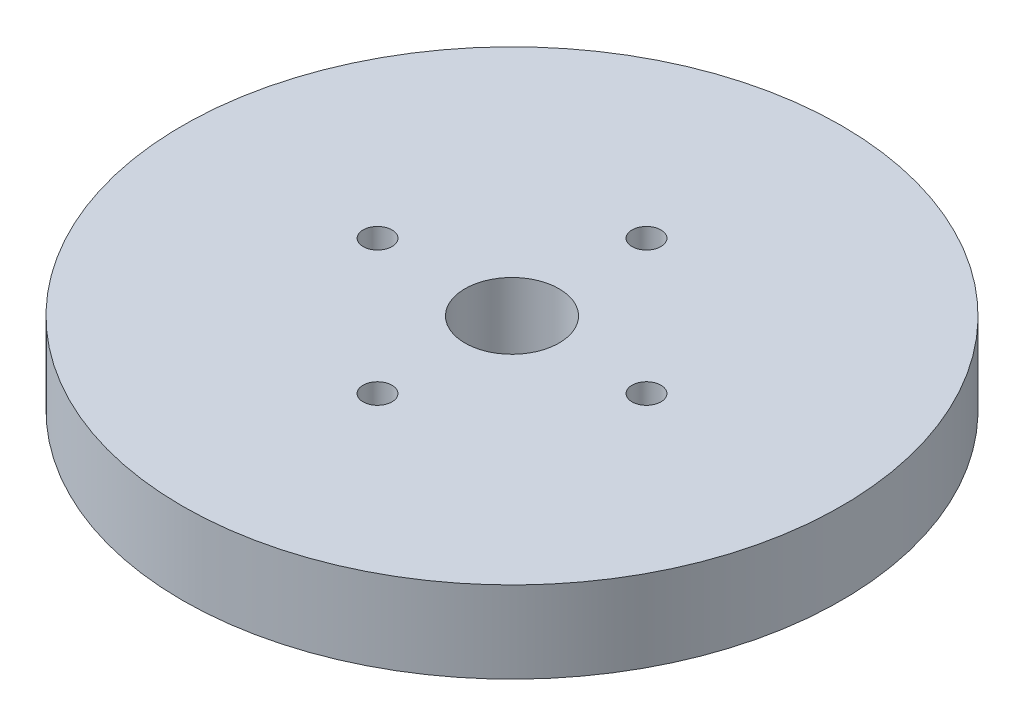
ISO-10303-21;
HEADER;
FILE_DESCRIPTION(('STEP AP214'),'2;1');
FILE_NAME('part.step','',(''),(''),'','','');
FILE_SCHEMA(('AUTOMOTIVE_DESIGN { 1 0 10303 214 1 1 1 1 }'));
ENDSEC;
DATA;
#1=APPLICATION_CONTEXT('core data for automotive mechanical design processes');
#2=APPLICATION_PROTOCOL_DEFINITION('international standard','automotive_design',2000,#1);
#3=PRODUCT_CONTEXT('',#1,'mechanical');
#4=PRODUCT('Part','Part','',(#3));
#5=PRODUCT_RELATED_PRODUCT_CATEGORY('part','',(#4));
#6=PRODUCT_DEFINITION_FORMATION('','',#4);
#7=PRODUCT_DEFINITION_CONTEXT('part definition',#1,'design');
#8=PRODUCT_DEFINITION('design','',#6,#7);
#9=PRODUCT_DEFINITION_SHAPE('','',#8);
#10=(LENGTH_UNIT() NAMED_UNIT(*) SI_UNIT(.MILLI.,.METRE.));
#11=(NAMED_UNIT(*) PLANE_ANGLE_UNIT() SI_UNIT($,.RADIAN.));
#12=(NAMED_UNIT(*) SI_UNIT($,.STERADIAN.) SOLID_ANGLE_UNIT());
#13=UNCERTAINTY_MEASURE_WITH_UNIT(LENGTH_MEASURE(1.E-05),#10,'distance_accuracy_value','');
#14=(GEOMETRIC_REPRESENTATION_CONTEXT(3) GLOBAL_UNCERTAINTY_ASSIGNED_CONTEXT((#13)) GLOBAL_UNIT_ASSIGNED_CONTEXT((#10,
#11,#12)) REPRESENTATION_CONTEXT('',''));
#15=CARTESIAN_POINT('',(0.,0.,0.));
#16=DIRECTION('',(0.,0.,1.));
#17=DIRECTION('',(1.,0.,0.));
#18=AXIS2_PLACEMENT_3D('',#15,#16,#17);
#19=CARTESIAN_POINT('',(0.,13.,0.));
#20=DIRECTION('',(0.,-1.,0.));
#21=DIRECTION('',(0.,0.,-1.));
#22=AXIS2_PLACEMENT_3D('',#19,#20,#21);
#23=CYLINDRICAL_SURFACE('',#22,52.5);
#24=CARTESIAN_POINT('',(0.,13.,0.));
#25=DIRECTION('',(0.,1.,0.));
#26=DIRECTION('',(0.,0.,1.));
#27=AXIS2_PLACEMENT_3D('',#24,#25,#26);
#28=CIRCLE('',#27,52.5);
#29=CARTESIAN_POINT('',(0.,13.,-52.5));
#30=VERTEX_POINT('',#29);
#31=EDGE_CURVE('E10',#30,#30,#28,.T.);
#32=CARTESIAN_POINT('',(0.,0.,0.));
#33=DIRECTION('',(0.,1.,0.));
#34=DIRECTION('',(0.,0.,1.));
#35=AXIS2_PLACEMENT_3D('',#32,#33,#34);
#36=CIRCLE('',#35,52.5);
#37=CARTESIAN_POINT('',(0.,0.,-52.5));
#38=VERTEX_POINT('',#37);
#39=EDGE_CURVE('E37',#38,#38,#36,.T.);
#40=CARTESIAN_POINT('',(0.,13.,-52.5));
#41=CARTESIAN_POINT('',(0.,12.8645833333333,-52.5));
#42=CARTESIAN_POINT('',(0.,12.7291666666667,-52.5));
#43=CARTESIAN_POINT('',(0.,12.4583333333333,-52.5));
#44=CARTESIAN_POINT('',(0.,12.3229166666667,-52.5));
#45=CARTESIAN_POINT('',(0.,12.0520833333333,-52.5));
#46=CARTESIAN_POINT('',(0.,11.9166666666667,-52.5));
#47=CARTESIAN_POINT('',(0.,11.6458333333333,-52.5));
#48=CARTESIAN_POINT('',(0.,11.5104166666667,-52.5));
#49=CARTESIAN_POINT('',(0.,11.2395833333333,-52.5));
#50=CARTESIAN_POINT('',(0.,11.1041666666667,-52.5));
#51=CARTESIAN_POINT('',(0.,10.8333333333333,-52.5));
#52=CARTESIAN_POINT('',(0.,10.6979166666667,-52.5));
#53=CARTESIAN_POINT('',(0.,10.4270833333333,-52.5));
#54=CARTESIAN_POINT('',(0.,10.2916666666667,-52.5));
#55=CARTESIAN_POINT('',(0.,10.0208333333333,-52.5));
#56=CARTESIAN_POINT('',(0.,9.88541666666667,-52.5));
#57=CARTESIAN_POINT('',(0.,9.61458333333333,-52.5));
#58=CARTESIAN_POINT('',(0.,9.47916666666667,-52.5));
#59=CARTESIAN_POINT('',(0.,9.20833333333333,-52.5));
#60=CARTESIAN_POINT('',(0.,9.07291666666667,-52.5));
#61=CARTESIAN_POINT('',(0.,8.80208333333333,-52.5));
#62=CARTESIAN_POINT('',(0.,8.66666666666667,-52.5));
#63=CARTESIAN_POINT('',(0.,8.39583333333333,-52.5));
#64=CARTESIAN_POINT('',(0.,8.26041666666667,-52.5));
#65=CARTESIAN_POINT('',(0.,7.98958333333333,-52.5));
#66=CARTESIAN_POINT('',(0.,7.85416666666667,-52.5));
#67=CARTESIAN_POINT('',(0.,7.58333333333333,-52.5));
#68=CARTESIAN_POINT('',(0.,7.44791666666667,-52.5));
#69=CARTESIAN_POINT('',(0.,7.17708333333333,-52.5));
#70=CARTESIAN_POINT('',(0.,7.04166666666667,-52.5));
#71=CARTESIAN_POINT('',(0.,6.77083333333333,-52.5));
#72=CARTESIAN_POINT('',(0.,6.63541666666667,-52.5));
#73=CARTESIAN_POINT('',(0.,6.36458333333333,-52.5));
#74=CARTESIAN_POINT('',(0.,6.22916666666667,-52.5));
#75=CARTESIAN_POINT('',(0.,5.95833333333333,-52.5));
#76=CARTESIAN_POINT('',(0.,5.82291666666667,-52.5));
#77=CARTESIAN_POINT('',(0.,5.55208333333333,-52.5));
#78=CARTESIAN_POINT('',(0.,5.41666666666667,-52.5));
#79=CARTESIAN_POINT('',(0.,5.14583333333333,-52.5));
#80=CARTESIAN_POINT('',(0.,5.01041666666667,-52.5));
#81=CARTESIAN_POINT('',(0.,4.73958333333333,-52.5));
#82=CARTESIAN_POINT('',(0.,4.60416666666667,-52.5));
#83=CARTESIAN_POINT('',(0.,4.33333333333333,-52.5));
#84=CARTESIAN_POINT('',(0.,4.19791666666667,-52.5));
#85=CARTESIAN_POINT('',(0.,3.92708333333333,-52.5));
#86=CARTESIAN_POINT('',(0.,3.79166666666667,-52.5));
#87=CARTESIAN_POINT('',(0.,3.52083333333333,-52.5));
#88=CARTESIAN_POINT('',(0.,3.38541666666667,-52.5));
#89=CARTESIAN_POINT('',(0.,3.11458333333333,-52.5));
#90=CARTESIAN_POINT('',(0.,2.97916666666667,-52.5));
#91=CARTESIAN_POINT('',(0.,2.70833333333333,-52.5));
#92=CARTESIAN_POINT('',(0.,2.57291666666667,-52.5));
#93=CARTESIAN_POINT('',(0.,2.30208333333333,-52.5));
#94=CARTESIAN_POINT('',(0.,2.16666666666667,-52.5));
#95=CARTESIAN_POINT('',(0.,1.89583333333333,-52.5));
#96=CARTESIAN_POINT('',(0.,1.76041666666667,-52.5));
#97=CARTESIAN_POINT('',(0.,1.48958333333333,-52.5));
#98=CARTESIAN_POINT('',(0.,1.35416666666667,-52.5));
#99=CARTESIAN_POINT('',(0.,1.08333333333333,-52.5));
#100=CARTESIAN_POINT('',(0.,0.947916666666667,-52.5));
#101=CARTESIAN_POINT('',(0.,0.677083333333334,-52.5));
#102=CARTESIAN_POINT('',(0.,0.541666666666667,-52.5));
#103=CARTESIAN_POINT('',(0.,0.270833333333334,-52.5));
#104=CARTESIAN_POINT('',(0.,0.135416666666667,-52.5));
#105=CARTESIAN_POINT('',(0.,0.,-52.5));
#106=B_SPLINE_CURVE_WITH_KNOTS('',3,(#40,#41,#42,#43,#44,#45,#46,#47,#48,#49,#50,#51,#52,#53,
#54,#55,#56,#57,#58,#59,#60,#61,#62,#63,#64,#65,#66,#67,#68,#69,#70,#71,#72,#73,#74,#75,#76,#77,
#78,#79,#80,#81,#82,#83,#84,#85,#86,#87,#88,#89,#90,#91,#92,#93,#94,#95,#96,#97,#98,#99,#100,
#101,#102,#103,#104,#105),.UNSPECIFIED.,.F.,.F.,(4,2,2,2,2,2,2,2,2,2,2,2,2,2,2,2,2,2,2,2,2,2,2,
2,2,2,2,2,2,2,2,2,4),(0.,0.406249999999999,0.812499999999999,1.21875,1.625,2.03125,2.4375,
2.84375,3.25,3.65625,4.0625,4.46875,4.875,5.28125,5.6875,6.09375,6.5,6.90625,7.3125,7.71875,
8.125,8.53125,8.9375,9.34375,9.75,10.15625,10.5625,10.96875,11.375,11.78125,12.1875,12.59375,
13.),.UNSPECIFIED.);
#107=EDGE_CURVE('BSEAM40',#30,#38,#106,.T.);
#108=ORIENTED_EDGE('',*,*,#31,.F.);
#109=ORIENTED_EDGE('',*,*,#39,.T.);
#110=ORIENTED_EDGE('',*,*,#107,.T.);
#111=ORIENTED_EDGE('',*,*,#107,.F.);
#112=EDGE_LOOP('',(#108,#110,#109,#111));
#113=FACE_BOUND('',#112,.T.);
#114=ADVANCED_FACE('F40',(#113),#23,.T.);
#115=CARTESIAN_POINT('',(0.,13.,0.));
#116=DIRECTION('',(0.,1.,0.));
#117=DIRECTION('',(0.,0.,1.));
#118=AXIS2_PLACEMENT_3D('',#115,#116,#117);
#119=PLANE('',#118);
#120=CARTESIAN_POINT('',(0.,13.,21.4229451490493));
#121=DIRECTION('',(0.,1.,0.));
#122=DIRECTION('',(1.,0.,0.));
#123=AXIS2_PLACEMENT_3D('',#120,#121,#122);
#124=CIRCLE('',#123,2.30515973345565);
#125=CARTESIAN_POINT('',(2.30515973345572,13.,21.4229451490493));
#126=VERTEX_POINT('',#125);
#127=EDGE_CURVE('E71',#126,#126,#124,.T.);
#128=ORIENTED_EDGE('',*,*,#127,.F.);
#129=EDGE_LOOP('',(#128));
#130=FACE_BOUND('',#129,.T.);
#131=CARTESIAN_POINT('',(21.4229451490493,13.,0.));
#132=DIRECTION('',(0.,1.,0.));
#133=DIRECTION('',(0.,0.,-1.));
#134=AXIS2_PLACEMENT_3D('',#131,#132,#133);
#135=CIRCLE('',#134,2.30515973345565);
#136=CARTESIAN_POINT('',(21.4229451490493,13.,-2.30515973345565));
#137=VERTEX_POINT('',#136);
#138=EDGE_CURVE('E70',#137,#137,#135,.T.);
#139=ORIENTED_EDGE('',*,*,#138,.F.);
#140=EDGE_LOOP('',(#139));
#141=FACE_BOUND('',#140,.T.);
#142=CARTESIAN_POINT('',(-2.24393439632897E-13,13.,-21.4229451490493));
#143=DIRECTION('',(0.,1.,0.));
#144=DIRECTION('',(-1.,0.,0.));
#145=AXIS2_PLACEMENT_3D('',#142,#143,#144);
#146=CIRCLE('',#145,2.30515973345565);
#147=CARTESIAN_POINT('',(-2.30515973345587,13.,-21.4229451490493));
#148=VERTEX_POINT('',#147);
#149=EDGE_CURVE('E61',#148,#148,#146,.T.);
#150=ORIENTED_EDGE('',*,*,#149,.F.);
#151=EDGE_LOOP('',(#150));
#152=FACE_BOUND('',#151,.T.);
#153=CARTESIAN_POINT('',(-21.4229451490493,13.,0.));
#154=DIRECTION('',(0.,1.,0.));
#155=DIRECTION('',(0.,0.,1.));
#156=AXIS2_PLACEMENT_3D('',#153,#154,#155);
#157=CIRCLE('',#156,2.30515973345565);
#158=CARTESIAN_POINT('',(-21.4229451490493,13.,2.30515973345565));
#159=VERTEX_POINT('',#158);
#160=EDGE_CURVE('E54',#159,#159,#157,.T.);
#161=ORIENTED_EDGE('',*,*,#160,.F.);
#162=EDGE_LOOP('',(#161));
#163=FACE_BOUND('',#162,.T.);
#164=CARTESIAN_POINT('',(0.,13.,0.));
#165=DIRECTION('',(0.,1.,0.));
#166=DIRECTION('',(0.,0.,1.));
#167=AXIS2_PLACEMENT_3D('',#164,#165,#166);
#168=CIRCLE('',#167,7.5);
#169=CARTESIAN_POINT('',(0.,13.,-7.5));
#170=VERTEX_POINT('',#169);
#171=EDGE_CURVE('E50',#170,#170,#168,.T.);
#172=ORIENTED_EDGE('',*,*,#171,.F.);
#173=EDGE_LOOP('',(#172));
#174=FACE_BOUND('',#173,.T.);
#175=ORIENTED_EDGE('',*,*,#31,.T.);
#176=EDGE_LOOP('',(#175));
#177=FACE_BOUND('',#176,.T.);
#178=ADVANCED_FACE('F86',(#130,#141,#152,#163,#174,#177),#119,.T.);
#179=CARTESIAN_POINT('',(0.,0.,0.));
#180=DIRECTION('',(0.,1.,0.));
#181=DIRECTION('',(0.,0.,1.));
#182=AXIS2_PLACEMENT_3D('',#179,#180,#181);
#183=PLANE('',#182);
#184=CARTESIAN_POINT('',(0.,0.,0.));
#185=DIRECTION('',(0.,1.,0.));
#186=DIRECTION('',(0.,0.,1.));
#187=AXIS2_PLACEMENT_3D('',#184,#185,#186);
#188=CIRCLE('',#187,7.5);
#189=CARTESIAN_POINT('',(0.,0.,-7.5));
#190=VERTEX_POINT('',#189);
#191=EDGE_CURVE('E47',#190,#190,#188,.T.);
#192=ORIENTED_EDGE('',*,*,#191,.T.);
#193=EDGE_LOOP('',(#192));
#194=FACE_BOUND('',#193,.T.);
#195=ORIENTED_EDGE('',*,*,#39,.F.);
#196=EDGE_LOOP('',(#195));
#197=FACE_BOUND('',#196,.T.);
#198=ADVANCED_FACE('F93',(#194,#197),#183,.F.);
#199=CARTESIAN_POINT('',(0.,13.,0.));
#200=DIRECTION('',(0.,-1.,0.));
#201=DIRECTION('',(0.,0.,-1.));
#202=AXIS2_PLACEMENT_3D('',#199,#200,#201);
#203=CYLINDRICAL_SURFACE('',#202,7.5);
#204=CARTESIAN_POINT('',(0.,13.,-7.5));
#205=CARTESIAN_POINT('',(0.,12.8645833333333,-7.5));
#206=CARTESIAN_POINT('',(0.,12.7291666666667,-7.5));
#207=CARTESIAN_POINT('',(0.,12.4583333333333,-7.5));
#208=CARTESIAN_POINT('',(0.,12.3229166666667,-7.5));
#209=CARTESIAN_POINT('',(0.,12.0520833333333,-7.5));
#210=CARTESIAN_POINT('',(0.,11.9166666666667,-7.5));
#211=CARTESIAN_POINT('',(0.,11.6458333333333,-7.5));
#212=CARTESIAN_POINT('',(0.,11.5104166666667,-7.5));
#213=CARTESIAN_POINT('',(0.,11.2395833333333,-7.5));
#214=CARTESIAN_POINT('',(0.,11.1041666666667,-7.5));
#215=CARTESIAN_POINT('',(0.,10.8333333333333,-7.5));
#216=CARTESIAN_POINT('',(0.,10.6979166666667,-7.5));
#217=CARTESIAN_POINT('',(0.,10.4270833333333,-7.5));
#218=CARTESIAN_POINT('',(0.,10.2916666666667,-7.5));
#219=CARTESIAN_POINT('',(0.,10.0208333333333,-7.5));
#220=CARTESIAN_POINT('',(0.,9.88541666666667,-7.5));
#221=CARTESIAN_POINT('',(0.,9.61458333333333,-7.5));
#222=CARTESIAN_POINT('',(0.,9.47916666666667,-7.5));
#223=CARTESIAN_POINT('',(0.,9.20833333333333,-7.5));
#224=CARTESIAN_POINT('',(0.,9.07291666666666,-7.5));
#225=CARTESIAN_POINT('',(0.,8.80208333333333,-7.5));
#226=CARTESIAN_POINT('',(0.,8.66666666666667,-7.5));
#227=CARTESIAN_POINT('',(0.,8.39583333333333,-7.5));
#228=CARTESIAN_POINT('',(0.,8.26041666666667,-7.5));
#229=CARTESIAN_POINT('',(0.,7.98958333333333,-7.5));
#230=CARTESIAN_POINT('',(0.,7.85416666666667,-7.5));
#231=CARTESIAN_POINT('',(0.,7.58333333333333,-7.5));
#232=CARTESIAN_POINT('',(0.,7.44791666666667,-7.5));
#233=CARTESIAN_POINT('',(0.,7.17708333333333,-7.5));
#234=CARTESIAN_POINT('',(0.,7.04166666666667,-7.5));
#235=CARTESIAN_POINT('',(0.,6.77083333333333,-7.5));
#236=CARTESIAN_POINT('',(0.,6.63541666666667,-7.5));
#237=CARTESIAN_POINT('',(0.,6.36458333333333,-7.5));
#238=CARTESIAN_POINT('',(0.,6.22916666666667,-7.5));
#239=CARTESIAN_POINT('',(0.,5.95833333333333,-7.5));
#240=CARTESIAN_POINT('',(0.,5.82291666666667,-7.5));
#241=CARTESIAN_POINT('',(0.,5.55208333333333,-7.5));
#242=CARTESIAN_POINT('',(0.,5.41666666666667,-7.5));
#243=CARTESIAN_POINT('',(0.,5.14583333333333,-7.5));
#244=CARTESIAN_POINT('',(0.,5.01041666666667,-7.5));
#245=CARTESIAN_POINT('',(0.,4.73958333333333,-7.5));
#246=CARTESIAN_POINT('',(0.,4.60416666666667,-7.5));
#247=CARTESIAN_POINT('',(0.,4.33333333333333,-7.5));
#248=CARTESIAN_POINT('',(0.,4.19791666666667,-7.5));
#249=CARTESIAN_POINT('',(0.,3.92708333333333,-7.5));
#250=CARTESIAN_POINT('',(0.,3.79166666666667,-7.5));
#251=CARTESIAN_POINT('',(0.,3.52083333333333,-7.5));
#252=CARTESIAN_POINT('',(0.,3.38541666666667,-7.5));
#253=CARTESIAN_POINT('',(0.,3.11458333333333,-7.5));
#254=CARTESIAN_POINT('',(0.,2.97916666666667,-7.5));
#255=CARTESIAN_POINT('',(0.,2.70833333333333,-7.5));
#256=CARTESIAN_POINT('',(0.,2.57291666666667,-7.5));
#257=CARTESIAN_POINT('',(0.,2.30208333333333,-7.5));
#258=CARTESIAN_POINT('',(0.,2.16666666666667,-7.5));
#259=CARTESIAN_POINT('',(0.,1.89583333333333,-7.5));
#260=CARTESIAN_POINT('',(0.,1.76041666666667,-7.5));
#261=CARTESIAN_POINT('',(0.,1.48958333333333,-7.5));
#262=CARTESIAN_POINT('',(0.,1.35416666666667,-7.5));
#263=CARTESIAN_POINT('',(0.,1.08333333333333,-7.5));
#264=CARTESIAN_POINT('',(0.,0.947916666666667,-7.5));
#265=CARTESIAN_POINT('',(0.,0.677083333333334,-7.5));
#266=CARTESIAN_POINT('',(0.,0.541666666666667,-7.5));
#267=CARTESIAN_POINT('',(0.,0.270833333333334,-7.5));
#268=CARTESIAN_POINT('',(0.,0.135416666666667,-7.5));
#269=CARTESIAN_POINT('',(0.,0.,-7.5));
#270=B_SPLINE_CURVE_WITH_KNOTS('',3,(#204,#205,#206,#207,#208,#209,#210,#211,#212,#213,#214,
#215,#216,#217,#218,#219,#220,#221,#222,#223,#224,#225,#226,#227,#228,#229,#230,#231,#232,#233,
#234,#235,#236,#237,#238,#239,#240,#241,#242,#243,#244,#245,#246,#247,#248,#249,#250,#251,#252,
#253,#254,#255,#256,#257,#258,#259,#260,#261,#262,#263,#264,#265,#266,#267,#268,#269),
.UNSPECIFIED.,.F.,.F.,(4,2,2,2,2,2,2,2,2,2,2,2,2,2,2,2,2,2,2,2,2,2,2,2,2,2,2,2,2,2,2,2,4),(0.,
0.40625,0.812500000000001,1.21875,1.625,2.03125,2.4375,2.84375,3.25,3.65625,4.0625,4.46875,
4.875,5.28125,5.6875,6.09375,6.5,6.90625,7.3125,7.71875,8.125,8.53125,8.9375,9.34375,9.75,
10.15625,10.5625,10.96875,11.375,11.78125,12.1875,12.59375,13.),.UNSPECIFIED.);
#271=EDGE_CURVE('BSEAM101',#170,#190,#270,.T.);
#272=ORIENTED_EDGE('',*,*,#171,.T.);
#273=ORIENTED_EDGE('',*,*,#191,.F.);
#274=ORIENTED_EDGE('',*,*,#271,.T.);
#275=ORIENTED_EDGE('',*,*,#271,.F.);
#276=EDGE_LOOP('',(#272,#274,#273,#275));
#277=FACE_BOUND('',#276,.T.);
#278=ADVANCED_FACE('F101',(#277),#203,.F.);
#279=CARTESIAN_POINT('',(-21.4229451490493,4.15702462687605,0.));
#280=DIRECTION('',(0.,1.,0.));
#281=DIRECTION('',(0.,0.,1.));
#282=AXIS2_PLACEMENT_3D('',#279,#280,#281);
#283=CYLINDRICAL_SURFACE('',#282,2.30515973345565);
#284=CARTESIAN_POINT('',(-21.4229451490493,4.15702462687605,0.));
#285=DIRECTION('',(0.,1.,0.));
#286=DIRECTION('',(0.,0.,1.));
#287=AXIS2_PLACEMENT_3D('',#284,#285,#286);
#288=CIRCLE('',#287,2.30515973345565);
#289=CARTESIAN_POINT('',(-21.4229451490493,4.15702462687605,2.30515973345565));
#290=VERTEX_POINT('',#289);
#291=EDGE_CURVE('E55',#290,#290,#288,.T.);
#292=ORIENTED_EDGE('',*,*,#291,.F.);
#293=EDGE_LOOP('',(#292));
#294=FACE_BOUND('',#293,.T.);
#295=ORIENTED_EDGE('',*,*,#160,.T.);
#296=EDGE_LOOP('',(#295));
#297=FACE_BOUND('',#296,.T.);
#298=ADVANCED_FACE('F102',(#294,#297),#283,.F.);
#299=CARTESIAN_POINT('',(-21.4229451490493,4.15702462687605,0.));
#300=DIRECTION('',(0.,1.,0.));
#301=DIRECTION('',(0.,0.,1.));
#302=AXIS2_PLACEMENT_3D('',#299,#300,#301);
#303=PLANE('',#302);
#304=ORIENTED_EDGE('',*,*,#291,.T.);
#305=EDGE_LOOP('',(#304));
#306=FACE_BOUND('',#305,.T.);
#307=ADVANCED_FACE('F133',(#306),#303,.T.);
#308=CARTESIAN_POINT('',(-2.24393439632897E-13,4.15702462687605,-21.4229451490493));
#309=DIRECTION('',(0.,1.,0.));
#310=DIRECTION('',(0.,0.,1.));
#311=AXIS2_PLACEMENT_3D('',#308,#309,#310);
#312=CYLINDRICAL_SURFACE('',#311,2.30515973345565);
#313=CARTESIAN_POINT('',(-2.24393439632897E-13,4.15702462687605,-21.4229451490493));
#314=DIRECTION('',(0.,1.,0.));
#315=DIRECTION('',(-1.,0.,0.));
#316=AXIS2_PLACEMENT_3D('',#313,#314,#315);
#317=CIRCLE('',#316,2.30515973345565);
#318=CARTESIAN_POINT('',(-2.30515973345587,4.15702462687605,-21.4229451490493));
#319=VERTEX_POINT('',#318);
#320=EDGE_CURVE('E63',#319,#319,#317,.T.);
#321=ORIENTED_EDGE('',*,*,#320,.F.);
#322=EDGE_LOOP('',(#321));
#323=FACE_BOUND('',#322,.T.);
#324=ORIENTED_EDGE('',*,*,#149,.T.);
#325=EDGE_LOOP('',(#324));
#326=FACE_BOUND('',#325,.T.);
#327=ADVANCED_FACE('F142',(#323,#326),#312,.F.);
#328=CARTESIAN_POINT('',(-2.24393439632897E-13,4.15702462687605,-21.4229451490493));
#329=DIRECTION('',(0.,1.,0.));
#330=DIRECTION('',(-1.,0.,0.));
#331=AXIS2_PLACEMENT_3D('',#328,#329,#330);
#332=PLANE('',#331);
#333=ORIENTED_EDGE('',*,*,#320,.T.);
#334=EDGE_LOOP('',(#333));
#335=FACE_BOUND('',#334,.T.);
#336=ADVANCED_FACE('F156',(#335),#332,.T.);
#337=CARTESIAN_POINT('',(21.4229451490493,4.15702462687605,0.));
#338=DIRECTION('',(0.,1.,0.));
#339=DIRECTION('',(0.,0.,1.));
#340=AXIS2_PLACEMENT_3D('',#337,#338,#339);
#341=CYLINDRICAL_SURFACE('',#340,2.30515973345565);
#342=CARTESIAN_POINT('',(21.4229451490493,4.15702462687605,0.));
#343=DIRECTION('',(0.,1.,0.));
#344=DIRECTION('',(0.,0.,-1.));
#345=AXIS2_PLACEMENT_3D('',#342,#343,#344);
#346=CIRCLE('',#345,2.30515973345565);
#347=CARTESIAN_POINT('',(21.4229451490493,4.15702462687605,-2.30515973345565));
#348=VERTEX_POINT('',#347);
#349=EDGE_CURVE('E69',#348,#348,#346,.T.);
#350=ORIENTED_EDGE('',*,*,#349,.F.);
#351=EDGE_LOOP('',(#350));
#352=FACE_BOUND('',#351,.T.);
#353=ORIENTED_EDGE('',*,*,#138,.T.);
#354=EDGE_LOOP('',(#353));
#355=FACE_BOUND('',#354,.T.);
#356=ADVANCED_FACE('F164',(#352,#355),#341,.F.);
#357=CARTESIAN_POINT('',(21.4229451490493,4.15702462687605,0.));
#358=DIRECTION('',(0.,1.,0.));
#359=DIRECTION('',(0.,0.,-1.));
#360=AXIS2_PLACEMENT_3D('',#357,#358,#359);
#361=PLANE('',#360);
#362=ORIENTED_EDGE('',*,*,#349,.T.);
#363=EDGE_LOOP('',(#362));
#364=FACE_BOUND('',#363,.T.);
#365=ADVANCED_FACE('F83',(#364),#361,.T.);
#366=CARTESIAN_POINT('',(0.,4.15702462687605,21.4229451490493));
#367=DIRECTION('',(0.,1.,0.));
#368=DIRECTION('',(0.,0.,1.));
#369=AXIS2_PLACEMENT_3D('',#366,#367,#368);
#370=CYLINDRICAL_SURFACE('',#369,2.30515973345565);
#371=CARTESIAN_POINT('',(0.,4.15702462687605,21.4229451490493));
#372=DIRECTION('',(0.,1.,0.));
#373=DIRECTION('',(1.,0.,0.));
#374=AXIS2_PLACEMENT_3D('',#371,#372,#373);
#375=CIRCLE('',#374,2.30515973345565);
#376=CARTESIAN_POINT('',(2.30515973345572,4.15702462687605,21.4229451490493));
#377=VERTEX_POINT('',#376);
#378=EDGE_CURVE('E59',#377,#377,#375,.T.);
#379=ORIENTED_EDGE('',*,*,#378,.F.);
#380=EDGE_LOOP('',(#379));
#381=FACE_BOUND('',#380,.T.);
#382=ORIENTED_EDGE('',*,*,#127,.T.);
#383=EDGE_LOOP('',(#382));
#384=FACE_BOUND('',#383,.T.);
#385=ADVANCED_FACE('F81',(#381,#384),#370,.F.);
#386=CARTESIAN_POINT('',(0.,4.15702462687605,21.4229451490493));
#387=DIRECTION('',(0.,1.,0.));
#388=DIRECTION('',(1.,0.,0.));
#389=AXIS2_PLACEMENT_3D('',#386,#387,#388);
#390=PLANE('',#389);
#391=ORIENTED_EDGE('',*,*,#378,.T.);
#392=EDGE_LOOP('',(#391));
#393=FACE_BOUND('',#392,.T.);
#394=ADVANCED_FACE('F78',(#393),#390,.T.);
#395=CLOSED_SHELL('',(#114,#178,#198,#278,#298,#307,#327,#336,#356,#365,#385,#394));
#396=MANIFOLD_SOLID_BREP('B2',#395);
#397=ADVANCED_BREP_SHAPE_REPRESENTATION('',(#18,#396),#14);
#398=SHAPE_DEFINITION_REPRESENTATION(#9,#397);
ENDSEC;
END-ISO-10303-21;
